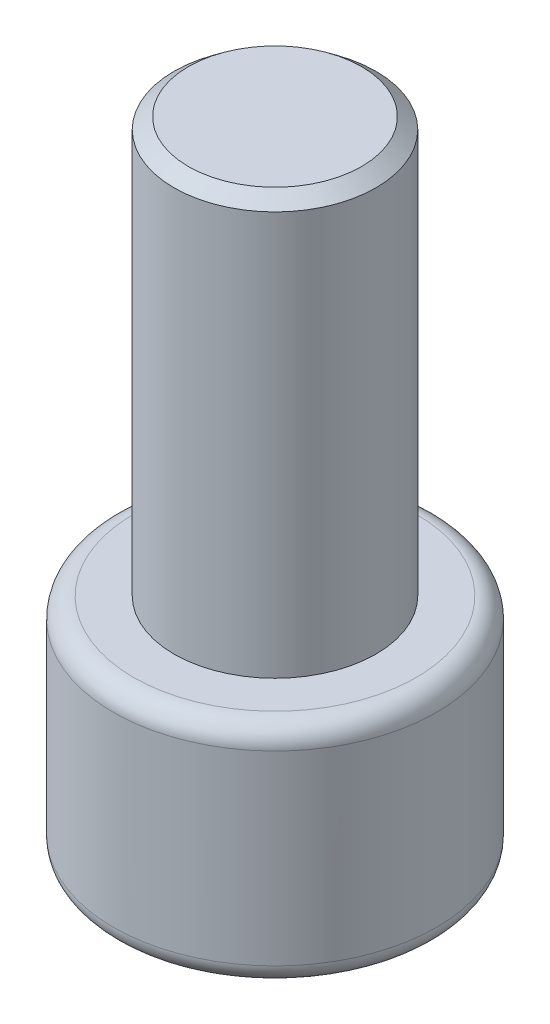
ISO-10303-21;
HEADER;
FILE_DESCRIPTION(('STEP AP214'),'2;1');
FILE_NAME('part.step','',(''),(''),'','','');
FILE_SCHEMA(('AUTOMOTIVE_DESIGN { 1 0 10303 214 1 1 1 1 }'));
ENDSEC;
DATA;
#1=APPLICATION_CONTEXT('core data for automotive mechanical design processes');
#2=APPLICATION_PROTOCOL_DEFINITION('international standard','automotive_design',2000,#1);
#3=PRODUCT_CONTEXT('',#1,'mechanical');
#4=PRODUCT('Part','Part','',(#3));
#5=PRODUCT_RELATED_PRODUCT_CATEGORY('part','',(#4));
#6=PRODUCT_DEFINITION_FORMATION('','',#4);
#7=PRODUCT_DEFINITION_CONTEXT('part definition',#1,'design');
#8=PRODUCT_DEFINITION('design','',#6,#7);
#9=PRODUCT_DEFINITION_SHAPE('','',#8);
#10=(LENGTH_UNIT() NAMED_UNIT(*) SI_UNIT(.MILLI.,.METRE.));
#11=(NAMED_UNIT(*) PLANE_ANGLE_UNIT() SI_UNIT($,.RADIAN.));
#12=(NAMED_UNIT(*) SI_UNIT($,.STERADIAN.) SOLID_ANGLE_UNIT());
#13=UNCERTAINTY_MEASURE_WITH_UNIT(LENGTH_MEASURE(1.E-05),#10,'distance_accuracy_value','');
#14=(GEOMETRIC_REPRESENTATION_CONTEXT(3) GLOBAL_UNCERTAINTY_ASSIGNED_CONTEXT((#13)) GLOBAL_UNIT_ASSIGNED_CONTEXT((#10,
#11,#12)) REPRESENTATION_CONTEXT('',''));
#15=CARTESIAN_POINT('',(0.,0.,0.));
#16=DIRECTION('',(0.,0.,1.));
#17=DIRECTION('',(1.,0.,0.));
#18=AXIS2_PLACEMENT_3D('',#15,#16,#17);
#19=CARTESIAN_POINT('',(0.,0.,0.));
#20=DIRECTION('',(0.,-1.,0.));
#21=DIRECTION('',(0.,0.,-1.));
#22=AXIS2_PLACEMENT_3D('',#19,#20,#21);
#23=CYLINDRICAL_SURFACE('',#22,8.);
#24=CARTESIAN_POINT('',(0.,1.,0.));
#25=DIRECTION('',(0.,1.,0.));
#26=DIRECTION('',(0.,0.,1.));
#27=AXIS2_PLACEMENT_3D('',#24,#25,#26);
#28=CIRCLE('',#27,8.);
#29=CARTESIAN_POINT('',(0.,1.,8.));
#30=VERTEX_POINT('',#29);
#31=EDGE_CURVE('E48',#30,#30,#28,.T.);
#32=ORIENTED_EDGE('',*,*,#31,.T.);
#33=EDGE_LOOP('',(#32));
#34=FACE_BOUND('',#33,.T.);
#35=CARTESIAN_POINT('',(0.,10.2163835876759,0.));
#36=DIRECTION('',(0.,-1.,0.));
#37=DIRECTION('',(0.,0.,-1.));
#38=AXIS2_PLACEMENT_3D('',#35,#36,#37);
#39=CIRCLE('',#38,8.);
#40=CARTESIAN_POINT('',(0.,10.2163835876759,-8.));
#41=VERTEX_POINT('',#40);
#42=EDGE_CURVE('E159',#41,#41,#39,.T.);
#43=ORIENTED_EDGE('',*,*,#42,.T.);
#44=EDGE_LOOP('',(#43));
#45=FACE_BOUND('',#44,.T.);
#46=ADVANCED_FACE('F40',(#34,#45),#23,.T.);
#47=CARTESIAN_POINT('',(0.,0.,0.));
#48=DIRECTION('',(0.,1.,0.));
#49=DIRECTION('',(0.,0.,1.));
#50=AXIS2_PLACEMENT_3D('',#47,#48,#49);
#51=PLANE('',#50);
#52=CARTESIAN_POINT('',(0.,0.,0.));
#53=DIRECTION('',(0.,1.,0.));
#54=DIRECTION('',(0.,0.,1.));
#55=AXIS2_PLACEMENT_3D('',#52,#53,#54);
#56=CIRCLE('',#55,7.);
#57=CARTESIAN_POINT('',(0.,0.,7.));
#58=VERTEX_POINT('',#57);
#59=EDGE_CURVE('E156',#58,#58,#56,.F.);
#60=ORIENTED_EDGE('',*,*,#59,.T.);
#61=EDGE_LOOP('',(#60));
#62=FACE_BOUND('',#61,.T.);
#63=DIRECTION('',(-0.866025403784439,0.,-0.5));
#64=VECTOR('',#63,1.);
#65=CARTESIAN_POINT('',(0.,0.,5.19615242270666));
#66=LINE('',#65,#64);
#67=CARTESIAN_POINT('',(0.,0.,5.19615242270666));
#68=VERTEX_POINT('',#67);
#69=CARTESIAN_POINT('',(-4.5,0.,2.59807621135333));
#70=VERTEX_POINT('',#69);
#71=EDGE_CURVE('E129',#68,#70,#66,.T.);
#72=ORIENTED_EDGE('',*,*,#71,.F.);
#73=DIRECTION('',(-0.866025403784439,0.,0.5));
#74=VECTOR('',#73,1.);
#75=CARTESIAN_POINT('',(4.5,0.,2.59807621135333));
#76=LINE('',#75,#74);
#77=CARTESIAN_POINT('',(4.5,0.,2.59807621135333));
#78=VERTEX_POINT('',#77);
#79=EDGE_CURVE('E55',#78,#68,#76,.T.);
#80=ORIENTED_EDGE('',*,*,#79,.F.);
#81=DIRECTION('',(0.,0.,1.));
#82=VECTOR('',#81,1.);
#83=CARTESIAN_POINT('',(4.5,0.,-2.59807621135333));
#84=LINE('',#83,#82);
#85=CARTESIAN_POINT('',(4.5,0.,-2.59807621135333));
#86=VERTEX_POINT('',#85);
#87=EDGE_CURVE('E138',#86,#78,#84,.T.);
#88=ORIENTED_EDGE('',*,*,#87,.F.);
#89=DIRECTION('',(0.866025403784439,0.,0.5));
#90=VECTOR('',#89,1.);
#91=CARTESIAN_POINT('',(0.,0.,-5.19615242270666));
#92=LINE('',#91,#90);
#93=CARTESIAN_POINT('',(0.,0.,-5.19615242270666));
#94=VERTEX_POINT('',#93);
#95=EDGE_CURVE('E136',#94,#86,#92,.T.);
#96=ORIENTED_EDGE('',*,*,#95,.F.);
#97=DIRECTION('',(0.866025403784439,0.,-0.5));
#98=VECTOR('',#97,1.);
#99=CARTESIAN_POINT('',(-4.5,0.,-2.59807621135333));
#100=LINE('',#99,#98);
#101=CARTESIAN_POINT('',(-4.5,0.,-2.59807621135333));
#102=VERTEX_POINT('',#101);
#103=EDGE_CURVE('E103',#102,#94,#100,.T.);
#104=ORIENTED_EDGE('',*,*,#103,.F.);
#105=DIRECTION('',(0.,0.,-1.));
#106=VECTOR('',#105,1.);
#107=CARTESIAN_POINT('',(-4.5,0.,2.59807621135333));
#108=LINE('',#107,#106);
#109=EDGE_CURVE('E132',#70,#102,#108,.T.);
#110=ORIENTED_EDGE('',*,*,#109,.F.);
#111=EDGE_LOOP('',(#72,#80,#88,#96,#104,#110));
#112=FACE_BOUND('',#111,.T.);
#113=ADVANCED_FACE('F171',(#62,#112),#51,.F.);
#114=CARTESIAN_POINT('',(0.,31.7724330394701,0.));
#115=DIRECTION('',(0.,1.,0.));
#116=DIRECTION('',(0.,0.,1.));
#117=AXIS2_PLACEMENT_3D('',#114,#115,#116);
#118=PLANE('',#117);
#119=CARTESIAN_POINT('',(0.,31.7724330394701,0.));
#120=DIRECTION('',(0.,-1.,0.));
#121=DIRECTION('',(0.,0.,-1.));
#122=AXIS2_PLACEMENT_3D('',#119,#120,#121);
#123=CIRCLE('',#122,4.28828915709058);
#124=CARTESIAN_POINT('',(0.,31.7724330394701,-4.28828915709058));
#125=VERTEX_POINT('',#124);
#126=EDGE_CURVE('E153',#125,#125,#123,.T.);
#127=ORIENTED_EDGE('',*,*,#126,.F.);
#128=EDGE_LOOP('',(#127));
#129=FACE_BOUND('',#128,.T.);
#130=ADVANCED_FACE('F174',(#129),#118,.T.);
#131=CARTESIAN_POINT('',(0.,31.2163835876759,0.));
#132=DIRECTION('',(0.,-1.,0.));
#133=DIRECTION('',(0.,0.,-1.));
#134=AXIS2_PLACEMENT_3D('',#131,#132,#133);
#135=CONICAL_SURFACE('',#134,5.,0.90757121103706);
#136=ORIENTED_EDGE('',*,*,#126,.T.);
#137=EDGE_LOOP('',(#136));
#138=FACE_BOUND('',#137,.T.);
#139=CARTESIAN_POINT('',(0.,31.2163835876759,0.));
#140=DIRECTION('',(0.,-1.,0.));
#141=DIRECTION('',(0.,0.,-1.));
#142=AXIS2_PLACEMENT_3D('',#139,#140,#141);
#143=CIRCLE('',#142,5.);
#144=CARTESIAN_POINT('',(0.,31.2163835876759,-5.));
#145=VERTEX_POINT('',#144);
#146=EDGE_CURVE('E150',#145,#145,#143,.T.);
#147=ORIENTED_EDGE('',*,*,#146,.F.);
#148=EDGE_LOOP('',(#147));
#149=FACE_BOUND('',#148,.T.);
#150=ADVANCED_FACE('F203',(#138,#149),#135,.T.);
#151=CARTESIAN_POINT('',(0.,0.,0.));
#152=DIRECTION('',(0.,-1.,0.));
#153=DIRECTION('',(0.,0.,-1.));
#154=AXIS2_PLACEMENT_3D('',#151,#152,#153);
#155=CYLINDRICAL_SURFACE('',#154,5.);
#156=CARTESIAN_POINT('',(0.,11.216383587676,0.));
#157=DIRECTION('',(0.,-1.,0.));
#158=DIRECTION('',(0.,0.,-1.));
#159=AXIS2_PLACEMENT_3D('',#156,#157,#158);
#160=CIRCLE('',#159,5.);
#161=CARTESIAN_POINT('',(0.,11.216383587676,-5.));
#162=VERTEX_POINT('',#161);
#163=EDGE_CURVE('E142',#162,#162,#160,.T.);
#164=ORIENTED_EDGE('',*,*,#163,.F.);
#165=EDGE_LOOP('',(#164));
#166=FACE_BOUND('',#165,.T.);
#167=ORIENTED_EDGE('',*,*,#146,.T.);
#168=EDGE_LOOP('',(#167));
#169=FACE_BOUND('',#168,.T.);
#170=ADVANCED_FACE('F192',(#166,#169),#155,.T.);
#171=CARTESIAN_POINT('',(0.,11.2163835876759,0.));
#172=DIRECTION('',(0.,-1.,0.));
#173=DIRECTION('',(0.,0.,-1.));
#174=AXIS2_PLACEMENT_3D('',#171,#172,#173);
#175=PLANE('',#174);
#176=CARTESIAN_POINT('',(0.,11.2163835876759,0.));
#177=DIRECTION('',(0.,-1.,0.));
#178=DIRECTION('',(0.,0.,-1.));
#179=AXIS2_PLACEMENT_3D('',#176,#177,#178);
#180=CIRCLE('',#179,7.);
#181=CARTESIAN_POINT('',(0.,11.2163835876759,-7.));
#182=VERTEX_POINT('',#181);
#183=EDGE_CURVE('E11',#182,#182,#180,.F.);
#184=ORIENTED_EDGE('',*,*,#183,.T.);
#185=EDGE_LOOP('',(#184));
#186=FACE_BOUND('',#185,.T.);
#187=ORIENTED_EDGE('',*,*,#163,.T.);
#188=EDGE_LOOP('',(#187));
#189=FACE_BOUND('',#188,.T.);
#190=ADVANCED_FACE('F185',(#186,#189),#175,.F.);
#191=CARTESIAN_POINT('',(4.5,7.00000000000001,2.59807621135333));
#192=DIRECTION('',(0.5,0.,0.866025403784439));
#193=DIRECTION('',(0.866025403784439,0.,-0.5));
#194=AXIS2_PLACEMENT_3D('',#191,#192,#193);
#195=PLANE('',#194);
#196=ORIENTED_EDGE('',*,*,#79,.T.);
#197=DIRECTION('',(0.,-1.,0.));
#198=VECTOR('',#197,1.);
#199=CARTESIAN_POINT('',(0.,7.00000000000001,5.19615242270666));
#200=LINE('',#199,#198);
#201=CARTESIAN_POINT('',(0.,7.00000000000001,5.19615242270666));
#202=VERTEX_POINT('',#201);
#203=EDGE_CURVE('E85',#202,#68,#200,.T.);
#204=ORIENTED_EDGE('',*,*,#203,.F.);
#205=DIRECTION('',(-0.866025403784439,0.,0.5));
#206=VECTOR('',#205,1.);
#207=CARTESIAN_POINT('',(4.5,7.00000000000001,2.59807621135333));
#208=LINE('',#207,#206);
#209=CARTESIAN_POINT('',(4.5,7.00000000000001,2.59807621135333));
#210=VERTEX_POINT('',#209);
#211=EDGE_CURVE('E140',#210,#202,#208,.T.);
#212=ORIENTED_EDGE('',*,*,#211,.F.);
#213=DIRECTION('',(0.,-1.,0.));
#214=VECTOR('',#213,1.);
#215=CARTESIAN_POINT('',(4.5,7.00000000000001,2.59807621135333));
#216=LINE('',#215,#214);
#217=EDGE_CURVE('E63',#210,#78,#216,.T.);
#218=ORIENTED_EDGE('',*,*,#217,.T.);
#219=EDGE_LOOP('',(#196,#204,#212,#218));
#220=FACE_BOUND('',#219,.T.);
#221=ADVANCED_FACE('F182',(#220),#195,.F.);
#222=CARTESIAN_POINT('',(4.5,7.00000000000001,-2.59807621135333));
#223=DIRECTION('',(1.,0.,0.));
#224=DIRECTION('',(0.,0.,-1.));
#225=AXIS2_PLACEMENT_3D('',#222,#223,#224);
#226=PLANE('',#225);
#227=ORIENTED_EDGE('',*,*,#87,.T.);
#228=ORIENTED_EDGE('',*,*,#217,.F.);
#229=DIRECTION('',(0.,0.,1.));
#230=VECTOR('',#229,1.);
#231=CARTESIAN_POINT('',(4.5,7.00000000000001,-2.59807621135333));
#232=LINE('',#231,#230);
#233=CARTESIAN_POINT('',(4.5,7.00000000000001,-2.59807621135333));
#234=VERTEX_POINT('',#233);
#235=EDGE_CURVE('E115',#234,#210,#232,.T.);
#236=ORIENTED_EDGE('',*,*,#235,.F.);
#237=DIRECTION('',(0.,-1.,0.));
#238=VECTOR('',#237,1.);
#239=CARTESIAN_POINT('',(4.5,7.00000000000001,-2.59807621135333));
#240=LINE('',#239,#238);
#241=EDGE_CURVE('E107',#234,#86,#240,.T.);
#242=ORIENTED_EDGE('',*,*,#241,.T.);
#243=EDGE_LOOP('',(#227,#228,#236,#242));
#244=FACE_BOUND('',#243,.T.);
#245=ADVANCED_FACE('F184',(#244),#226,.F.);
#246=CARTESIAN_POINT('',(0.,7.00000000000001,-5.19615242270666));
#247=DIRECTION('',(0.5,0.,-0.866025403784439));
#248=DIRECTION('',(-0.866025403784439,0.,-0.5));
#249=AXIS2_PLACEMENT_3D('',#246,#247,#248);
#250=PLANE('',#249);
#251=ORIENTED_EDGE('',*,*,#95,.T.);
#252=ORIENTED_EDGE('',*,*,#241,.F.);
#253=DIRECTION('',(0.866025403784439,0.,0.5));
#254=VECTOR('',#253,1.);
#255=CARTESIAN_POINT('',(0.,7.00000000000001,-5.19615242270666));
#256=LINE('',#255,#254);
#257=CARTESIAN_POINT('',(0.,7.00000000000001,-5.19615242270666));
#258=VERTEX_POINT('',#257);
#259=EDGE_CURVE('E111',#258,#234,#256,.T.);
#260=ORIENTED_EDGE('',*,*,#259,.F.);
#261=DIRECTION('',(0.,-1.,0.));
#262=VECTOR('',#261,1.);
#263=CARTESIAN_POINT('',(0.,7.00000000000001,-5.19615242270666));
#264=LINE('',#263,#262);
#265=EDGE_CURVE('E96',#258,#94,#264,.T.);
#266=ORIENTED_EDGE('',*,*,#265,.T.);
#267=EDGE_LOOP('',(#251,#252,#260,#266));
#268=FACE_BOUND('',#267,.T.);
#269=ADVANCED_FACE('F112',(#268),#250,.F.);
#270=CARTESIAN_POINT('',(-4.5,7.00000000000001,-2.59807621135333));
#271=DIRECTION('',(-0.5,0.,-0.866025403784439));
#272=DIRECTION('',(-0.866025403784439,0.,0.5));
#273=AXIS2_PLACEMENT_3D('',#270,#271,#272);
#274=PLANE('',#273);
#275=ORIENTED_EDGE('',*,*,#103,.T.);
#276=ORIENTED_EDGE('',*,*,#265,.F.);
#277=DIRECTION('',(0.866025403784439,0.,-0.5));
#278=VECTOR('',#277,1.);
#279=CARTESIAN_POINT('',(-4.5,7.00000000000001,-2.59807621135333));
#280=LINE('',#279,#278);
#281=CARTESIAN_POINT('',(-4.5,7.00000000000001,-2.59807621135333));
#282=VERTEX_POINT('',#281);
#283=EDGE_CURVE('E100',#282,#258,#280,.T.);
#284=ORIENTED_EDGE('',*,*,#283,.F.);
#285=DIRECTION('',(0.,-1.,0.));
#286=VECTOR('',#285,1.);
#287=CARTESIAN_POINT('',(-4.5,7.00000000000001,-2.59807621135333));
#288=LINE('',#287,#286);
#289=EDGE_CURVE('E108',#282,#102,#288,.T.);
#290=ORIENTED_EDGE('',*,*,#289,.T.);
#291=EDGE_LOOP('',(#275,#276,#284,#290));
#292=FACE_BOUND('',#291,.T.);
#293=ADVANCED_FACE('F98',(#292),#274,.F.);
#294=CARTESIAN_POINT('',(-4.5,7.00000000000001,2.59807621135333));
#295=DIRECTION('',(-1.,0.,0.));
#296=DIRECTION('',(0.,0.,1.));
#297=AXIS2_PLACEMENT_3D('',#294,#295,#296);
#298=PLANE('',#297);
#299=ORIENTED_EDGE('',*,*,#109,.T.);
#300=ORIENTED_EDGE('',*,*,#289,.F.);
#301=DIRECTION('',(0.,0.,-1.));
#302=VECTOR('',#301,1.);
#303=CARTESIAN_POINT('',(-4.5,7.00000000000001,2.59807621135333));
#304=LINE('',#303,#302);
#305=CARTESIAN_POINT('',(-4.5,7.00000000000001,2.59807621135333));
#306=VERTEX_POINT('',#305);
#307=EDGE_CURVE('E121',#306,#282,#304,.T.);
#308=ORIENTED_EDGE('',*,*,#307,.F.);
#309=DIRECTION('',(0.,-1.,0.));
#310=VECTOR('',#309,1.);
#311=CARTESIAN_POINT('',(-4.5,7.00000000000001,2.59807621135333));
#312=LINE('',#311,#310);
#313=EDGE_CURVE('E145',#306,#70,#312,.T.);
#314=ORIENTED_EDGE('',*,*,#313,.T.);
#315=EDGE_LOOP('',(#299,#300,#308,#314));
#316=FACE_BOUND('',#315,.T.);
#317=ADVANCED_FACE('F250',(#316),#298,.F.);
#318=CARTESIAN_POINT('',(0.,7.00000000000001,5.19615242270666));
#319=DIRECTION('',(-0.5,0.,0.866025403784439));
#320=DIRECTION('',(0.866025403784439,0.,0.5));
#321=AXIS2_PLACEMENT_3D('',#318,#319,#320);
#322=PLANE('',#321);
#323=ORIENTED_EDGE('',*,*,#71,.T.);
#324=ORIENTED_EDGE('',*,*,#313,.F.);
#325=DIRECTION('',(-0.866025403784439,0.,-0.5));
#326=VECTOR('',#325,1.);
#327=CARTESIAN_POINT('',(0.,7.00000000000001,5.19615242270666));
#328=LINE('',#327,#326);
#329=EDGE_CURVE('E123',#202,#306,#328,.T.);
#330=ORIENTED_EDGE('',*,*,#329,.F.);
#331=ORIENTED_EDGE('',*,*,#203,.T.);
#332=EDGE_LOOP('',(#323,#324,#330,#331));
#333=FACE_BOUND('',#332,.T.);
#334=ADVANCED_FACE('F180',(#333),#322,.F.);
#335=CARTESIAN_POINT('',(0.,7.00000000000001,0.));
#336=DIRECTION('',(0.,-1.,0.));
#337=DIRECTION('',(0.,0.,-1.));
#338=AXIS2_PLACEMENT_3D('',#335,#336,#337);
#339=PLANE('',#338);
#340=ORIENTED_EDGE('',*,*,#211,.T.);
#341=ORIENTED_EDGE('',*,*,#329,.T.);
#342=ORIENTED_EDGE('',*,*,#307,.T.);
#343=ORIENTED_EDGE('',*,*,#283,.T.);
#344=ORIENTED_EDGE('',*,*,#259,.T.);
#345=ORIENTED_EDGE('',*,*,#235,.T.);
#346=EDGE_LOOP('',(#340,#341,#342,#343,#344,#345));
#347=FACE_BOUND('',#346,.T.);
#348=ADVANCED_FACE('F118',(#347),#339,.T.);
#349=CARTESIAN_POINT('',(0.,1.,0.));
#350=DIRECTION('',(0.,1.,0.));
#351=DIRECTION('',(0.,0.,1.));
#352=AXIS2_PLACEMENT_3D('',#349,#350,#351);
#353=TOROIDAL_SURFACE('',#352,7.,1.);
#354=ORIENTED_EDGE('',*,*,#31,.F.);
#355=EDGE_LOOP('',(#354));
#356=FACE_BOUND('',#355,.T.);
#357=ORIENTED_EDGE('',*,*,#59,.F.);
#358=EDGE_LOOP('',(#357));
#359=FACE_BOUND('',#358,.T.);
#360=ADVANCED_FACE('F166',(#356,#359),#353,.T.);
#361=CARTESIAN_POINT('',(0.,10.2163835876759,0.));
#362=DIRECTION('',(0.,-1.,0.));
#363=DIRECTION('',(0.,0.,-1.));
#364=AXIS2_PLACEMENT_3D('',#361,#362,#363);
#365=TOROIDAL_SURFACE('',#364,7.,1.);
#366=ORIENTED_EDGE('',*,*,#183,.F.);
#367=EDGE_LOOP('',(#366));
#368=FACE_BOUND('',#367,.T.);
#369=ORIENTED_EDGE('',*,*,#42,.F.);
#370=EDGE_LOOP('',(#369));
#371=FACE_BOUND('',#370,.T.);
#372=ADVANCED_FACE('F42',(#368,#371),#365,.T.);
#373=CLOSED_SHELL('',(#46,#113,#130,#150,#170,#190,#221,#245,#269,#293,#317,#334,#348,#360,#372));
#374=MANIFOLD_SOLID_BREP('B2',#373);
#375=ADVANCED_BREP_SHAPE_REPRESENTATION('',(#18,#374),#14);
#376=SHAPE_DEFINITION_REPRESENTATION(#9,#375);
ENDSEC;
END-ISO-10303-21;
